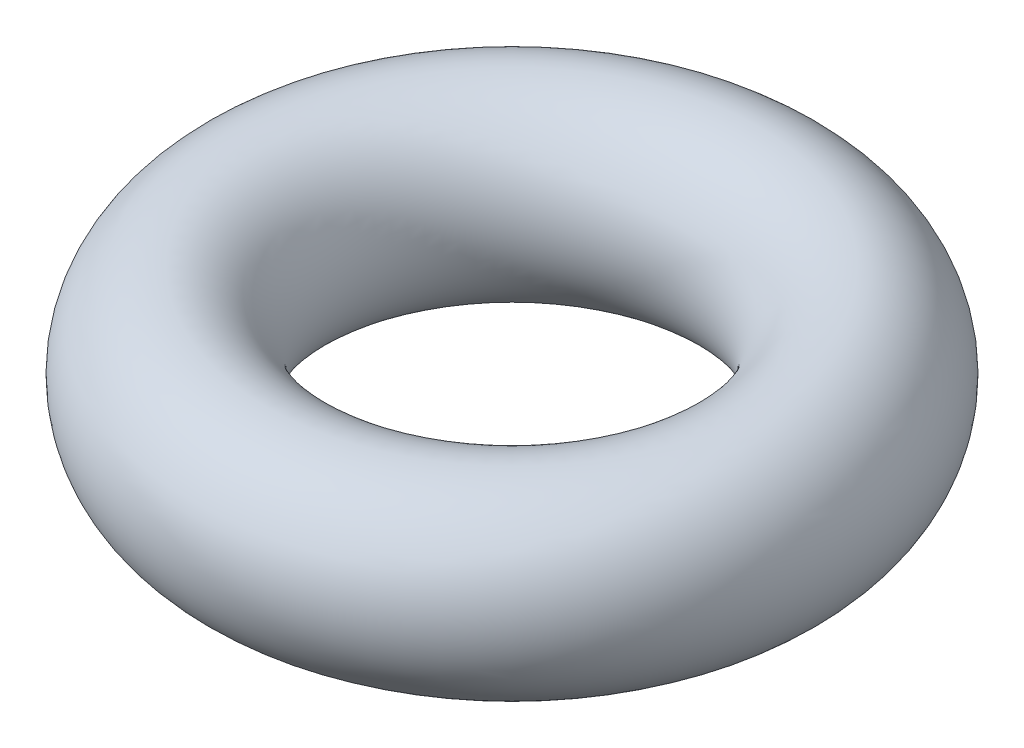
ISO-10303-21;
HEADER;
FILE_DESCRIPTION(('STEP AP214'),'2;1');
FILE_NAME('part.step','',(''),(''),'','','');
FILE_SCHEMA(('AUTOMOTIVE_DESIGN { 1 0 10303 214 1 1 1 1 }'));
ENDSEC;
DATA;
#1=APPLICATION_CONTEXT('core data for automotive mechanical design processes');
#2=APPLICATION_PROTOCOL_DEFINITION('international standard','automotive_design',2000,#1);
#3=PRODUCT_CONTEXT('',#1,'mechanical');
#4=PRODUCT('Part','Part','',(#3));
#5=PRODUCT_RELATED_PRODUCT_CATEGORY('part','',(#4));
#6=PRODUCT_DEFINITION_FORMATION('','',#4);
#7=PRODUCT_DEFINITION_CONTEXT('part definition',#1,'design');
#8=PRODUCT_DEFINITION('design','',#6,#7);
#9=PRODUCT_DEFINITION_SHAPE('','',#8);
#10=(LENGTH_UNIT() NAMED_UNIT(*) SI_UNIT(.MILLI.,.METRE.));
#11=(NAMED_UNIT(*) PLANE_ANGLE_UNIT() SI_UNIT($,.RADIAN.));
#12=(NAMED_UNIT(*) SI_UNIT($,.STERADIAN.) SOLID_ANGLE_UNIT());
#13=UNCERTAINTY_MEASURE_WITH_UNIT(LENGTH_MEASURE(1.E-05),#10,'distance_accuracy_value','');
#14=(GEOMETRIC_REPRESENTATION_CONTEXT(3) GLOBAL_UNCERTAINTY_ASSIGNED_CONTEXT((#13)) GLOBAL_UNIT_ASSIGNED_CONTEXT((#10,
#11,#12)) REPRESENTATION_CONTEXT('',''));
#15=CARTESIAN_POINT('',(0.,0.,0.));
#16=DIRECTION('',(0.,0.,1.));
#17=DIRECTION('',(1.,0.,0.));
#18=AXIS2_PLACEMENT_3D('',#15,#16,#17);
#19=CARTESIAN_POINT('',(-2.3,0.,0.));
#20=DIRECTION('',(0.,0.,1.));
#21=DIRECTION('',(0.,1.,0.));
#22=AXIS2_PLACEMENT_3D('',#19,#20,#21);
#23=ELLIPSE('',#22,0.875,0.8);
#24=CARTESIAN_POINT('',(0.,0.,0.));
#25=DIRECTION('',(0.,-1.,0.));
#26=AXIS1_PLACEMENT('',#24,#25);
#27=SURFACE_OF_REVOLUTION('',#23,#26);
#28=ADVANCED_FACE('F29',(),#27,.T.);
#29=CLOSED_SHELL('',(#28));
#30=MANIFOLD_SOLID_BREP('B2',#29);
#31=ADVANCED_BREP_SHAPE_REPRESENTATION('',(#18,#30),#14);
#32=SHAPE_DEFINITION_REPRESENTATION(#9,#31);
ENDSEC;
END-ISO-10303-21;
